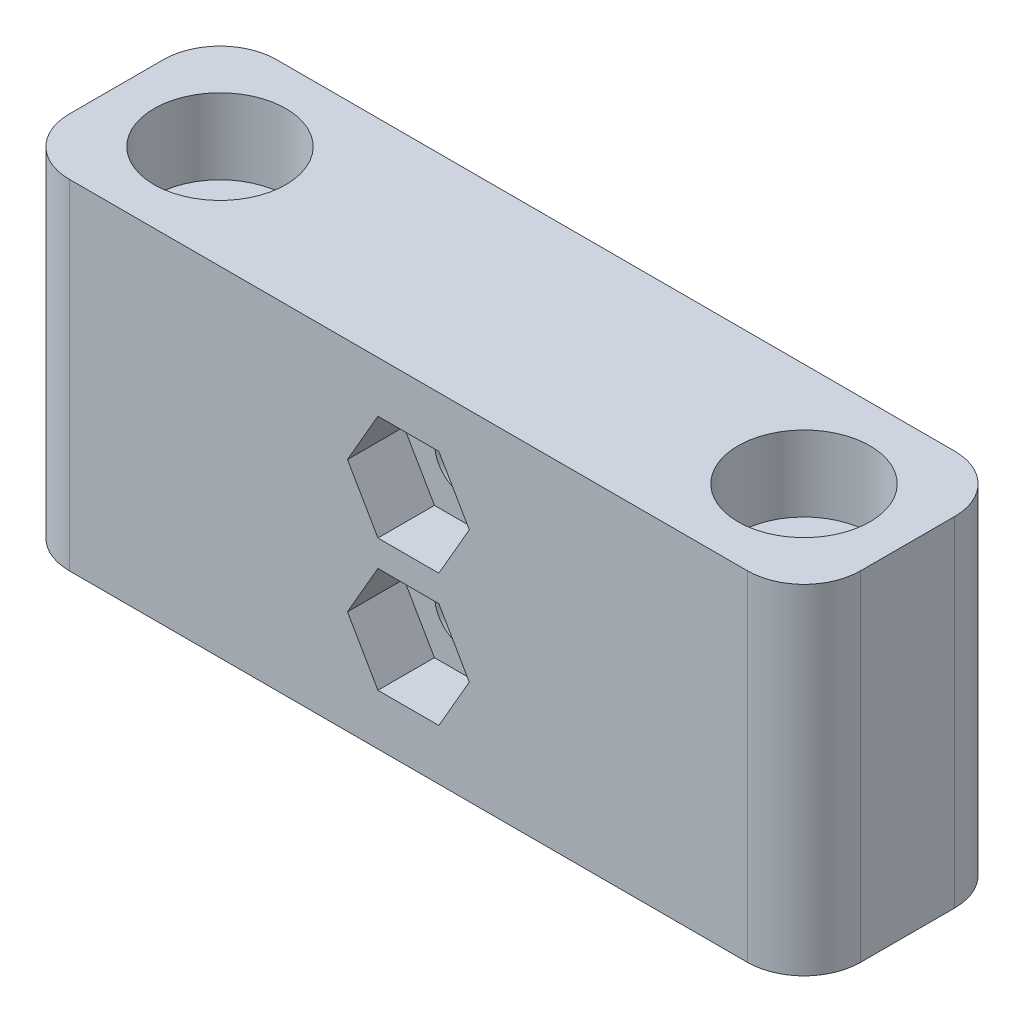
ISO-10303-21;
HEADER;
FILE_DESCRIPTION(('STEP AP214'),'2;1');
FILE_NAME('part.step','',(''),(''),'','','');
FILE_SCHEMA(('AUTOMOTIVE_DESIGN { 1 0 10303 214 1 1 1 1 }'));
ENDSEC;
DATA;
#1=APPLICATION_CONTEXT('core data for automotive mechanical design processes');
#2=APPLICATION_PROTOCOL_DEFINITION('international standard','automotive_design',2000,#1);
#3=PRODUCT_CONTEXT('',#1,'mechanical');
#4=PRODUCT('Part','Part','',(#3));
#5=PRODUCT_RELATED_PRODUCT_CATEGORY('part','',(#4));
#6=PRODUCT_DEFINITION_FORMATION('','',#4);
#7=PRODUCT_DEFINITION_CONTEXT('part definition',#1,'design');
#8=PRODUCT_DEFINITION('design','',#6,#7);
#9=PRODUCT_DEFINITION_SHAPE('','',#8);
#10=(LENGTH_UNIT() NAMED_UNIT(*) SI_UNIT(.MILLI.,.METRE.));
#11=(NAMED_UNIT(*) PLANE_ANGLE_UNIT() SI_UNIT($,.RADIAN.));
#12=(NAMED_UNIT(*) SI_UNIT($,.STERADIAN.) SOLID_ANGLE_UNIT());
#13=UNCERTAINTY_MEASURE_WITH_UNIT(LENGTH_MEASURE(1.E-05),#10,'distance_accuracy_value','');
#14=(GEOMETRIC_REPRESENTATION_CONTEXT(3) GLOBAL_UNCERTAINTY_ASSIGNED_CONTEXT((#13)) GLOBAL_UNIT_ASSIGNED_CONTEXT((#10,
#11,#12)) REPRESENTATION_CONTEXT('',''));
#15=CARTESIAN_POINT('',(0.,0.,0.));
#16=DIRECTION('',(0.,0.,1.));
#17=DIRECTION('',(1.,0.,0.));
#18=AXIS2_PLACEMENT_3D('',#15,#16,#17);
#19=CARTESIAN_POINT('',(-11.1557575960414,-8.24916440918298,62.8024606421806));
#20=DIRECTION('',(0.,0.,-1.));
#21=DIRECTION('',(-1.,0.,0.));
#22=AXIS2_PLACEMENT_3D('',#19,#20,#21);
#23=CYLINDRICAL_SURFACE('',#22,1.6);
#24=CARTESIAN_POINT('',(-11.1557575960414,-8.24916440918298,51.8024606421806));
#25=DIRECTION('',(0.,0.,-1.));
#26=DIRECTION('',(-1.,0.,0.));
#27=AXIS2_PLACEMENT_3D('',#24,#25,#26);
#28=CIRCLE('',#27,1.6);
#29=CARTESIAN_POINT('',(-12.7557575960414,-8.24916440918298,51.8024606421806));
#30=VERTEX_POINT('',#29);
#31=EDGE_CURVE('E278',#30,#30,#28,.T.);
#32=ORIENTED_EDGE('',*,*,#31,.T.);
#33=EDGE_LOOP('',(#32));
#34=FACE_BOUND('',#33,.T.);
#35=CARTESIAN_POINT('',(-11.1557575960414,-8.24916440918298,59.8024606421806));
#36=DIRECTION('',(0.,0.,1.));
#37=DIRECTION('',(1.,0.,0.));
#38=AXIS2_PLACEMENT_3D('',#35,#36,#37);
#39=CIRCLE('',#38,1.6);
#40=CARTESIAN_POINT('',(-9.55575759604137,-8.24916440918298,59.8024606421806));
#41=VERTEX_POINT('',#40);
#42=EDGE_CURVE('E38',#41,#41,#39,.F.);
#43=ORIENTED_EDGE('',*,*,#42,.F.);
#44=EDGE_LOOP('',(#43));
#45=FACE_BOUND('',#44,.T.);
#46=ADVANCED_FACE('F34',(#34,#45),#23,.F.);
#47=CARTESIAN_POINT('',(-11.1557575960414,-1.24916440918298,62.8024606421806));
#48=DIRECTION('',(0.,0.,-1.));
#49=DIRECTION('',(-1.,0.,0.));
#50=AXIS2_PLACEMENT_3D('',#47,#48,#49);
#51=CYLINDRICAL_SURFACE('',#50,1.6);
#52=CARTESIAN_POINT('',(-11.1557575960414,-1.24916440918298,51.8024606421806));
#53=DIRECTION('',(0.,0.,-1.));
#54=DIRECTION('',(-1.,0.,0.));
#55=AXIS2_PLACEMENT_3D('',#52,#53,#54);
#56=CIRCLE('',#55,1.6);
#57=CARTESIAN_POINT('',(-12.7557575960414,-1.24916440918298,51.8024606421806));
#58=VERTEX_POINT('',#57);
#59=EDGE_CURVE('E274',#58,#58,#56,.T.);
#60=ORIENTED_EDGE('',*,*,#59,.T.);
#61=EDGE_LOOP('',(#60));
#62=FACE_BOUND('',#61,.T.);
#63=CARTESIAN_POINT('',(-11.1557575960414,-1.24916440918298,59.8024606421806));
#64=DIRECTION('',(0.,0.,1.));
#65=DIRECTION('',(1.,0.,0.));
#66=AXIS2_PLACEMENT_3D('',#63,#64,#65);
#67=CIRCLE('',#66,1.6);
#68=CARTESIAN_POINT('',(-9.55575759604137,-1.24916440918298,59.8024606421806));
#69=VERTEX_POINT('',#68);
#70=EDGE_CURVE('E221',#69,#69,#67,.F.);
#71=ORIENTED_EDGE('',*,*,#70,.F.);
#72=EDGE_LOOP('',(#71));
#73=FACE_BOUND('',#72,.T.);
#74=ADVANCED_FACE('F368',(#62,#73),#51,.F.);
#75=CARTESIAN_POINT('',(-26.6557575960414,4.25083559081702,57.3024606421806));
#76=DIRECTION('',(0.,-1.,0.));
#77=DIRECTION('',(0.,0.,-1.));
#78=AXIS2_PLACEMENT_3D('',#75,#76,#77);
#79=CYLINDRICAL_SURFACE('',#78,1.6);
#80=CARTESIAN_POINT('',(-26.6557575960414,-13.749164409183,57.3024606421806));
#81=DIRECTION('',(0.,1.,0.));
#82=DIRECTION('',(0.,0.,1.));
#83=AXIS2_PLACEMENT_3D('',#80,#81,#82);
#84=CIRCLE('',#83,1.6);
#85=CARTESIAN_POINT('',(-26.6557575960414,-13.749164409183,58.9024606421806));
#86=VERTEX_POINT('',#85);
#87=EDGE_CURVE('E296',#86,#86,#84,.T.);
#88=ORIENTED_EDGE('',*,*,#87,.F.);
#89=EDGE_LOOP('',(#88));
#90=FACE_BOUND('',#89,.T.);
#91=CARTESIAN_POINT('',(-26.6557575960414,0.25083559081702,57.3024606421806));
#92=DIRECTION('',(0.,1.,0.));
#93=DIRECTION('',(0.,0.,1.));
#94=AXIS2_PLACEMENT_3D('',#91,#92,#93);
#95=CIRCLE('',#94,1.6);
#96=CARTESIAN_POINT('',(-26.6557575960414,0.25083559081702,58.9024606421806));
#97=VERTEX_POINT('',#96);
#98=EDGE_CURVE('E297',#97,#97,#95,.T.);
#99=ORIENTED_EDGE('',*,*,#98,.T.);
#100=EDGE_LOOP('',(#99));
#101=FACE_BOUND('',#100,.T.);
#102=ADVANCED_FACE('F374',(#90,#101),#79,.F.);
#103=CARTESIAN_POINT('',(4.34424240395863,4.25083559081702,57.3024606421806));
#104=DIRECTION('',(0.,-1.,0.));
#105=DIRECTION('',(0.,0.,-1.));
#106=AXIS2_PLACEMENT_3D('',#103,#104,#105);
#107=CYLINDRICAL_SURFACE('',#106,1.6);
#108=CARTESIAN_POINT('',(4.34424240395863,-13.749164409183,57.3024606421806));
#109=DIRECTION('',(0.,1.,0.));
#110=DIRECTION('',(0.,0.,1.));
#111=AXIS2_PLACEMENT_3D('',#108,#109,#110);
#112=CIRCLE('',#111,1.6);
#113=CARTESIAN_POINT('',(4.34424240395863,-13.749164409183,58.9024606421806));
#114=VERTEX_POINT('',#113);
#115=EDGE_CURVE('E293',#114,#114,#112,.T.);
#116=ORIENTED_EDGE('',*,*,#115,.F.);
#117=EDGE_LOOP('',(#116));
#118=FACE_BOUND('',#117,.T.);
#119=CARTESIAN_POINT('',(4.34424240395863,0.25083559081702,57.3024606421806));
#120=DIRECTION('',(0.,1.,0.));
#121=DIRECTION('',(0.,0.,1.));
#122=AXIS2_PLACEMENT_3D('',#119,#120,#121);
#123=CIRCLE('',#122,1.6);
#124=CARTESIAN_POINT('',(4.34424240395863,0.25083559081702,58.9024606421806));
#125=VERTEX_POINT('',#124);
#126=EDGE_CURVE('E284',#125,#125,#123,.T.);
#127=ORIENTED_EDGE('',*,*,#126,.T.);
#128=EDGE_LOOP('',(#127));
#129=FACE_BOUND('',#128,.T.);
#130=ADVANCED_FACE('F395',(#118,#129),#107,.F.);
#131=CARTESIAN_POINT('',(0.,4.25083559081702,0.));
#132=DIRECTION('',(0.,1.,0.));
#133=DIRECTION('',(0.,0.,1.));
#134=AXIS2_PLACEMENT_3D('',#131,#132,#133);
#135=PLANE('',#134);
#136=CARTESIAN_POINT('',(-26.6557575960414,4.25083559081702,57.3024606421806));
#137=DIRECTION('',(0.,1.,0.));
#138=DIRECTION('',(0.,0.,1.));
#139=AXIS2_PLACEMENT_3D('',#136,#137,#138);
#140=CIRCLE('',#139,3.5);
#141=CARTESIAN_POINT('',(-26.6557575960414,4.25083559081702,60.8024606421806));
#142=VERTEX_POINT('',#141);
#143=EDGE_CURVE('E285',#142,#142,#140,.T.);
#144=ORIENTED_EDGE('',*,*,#143,.F.);
#145=EDGE_LOOP('',(#144));
#146=FACE_BOUND('',#145,.T.);
#147=CARTESIAN_POINT('',(4.34424240395863,4.25083559081702,57.3024606421806));
#148=DIRECTION('',(0.,1.,0.));
#149=DIRECTION('',(0.,0.,1.));
#150=AXIS2_PLACEMENT_3D('',#147,#148,#149);
#151=CIRCLE('',#150,3.5);
#152=CARTESIAN_POINT('',(4.34424240395863,4.25083559081702,60.8024606421806));
#153=VERTEX_POINT('',#152);
#154=EDGE_CURVE('E277',#153,#153,#151,.T.);
#155=ORIENTED_EDGE('',*,*,#154,.F.);
#156=EDGE_LOOP('',(#155));
#157=FACE_BOUND('',#156,.T.);
#158=DIRECTION('',(1.,0.,0.));
#159=VECTOR('',#158,1.);
#160=CARTESIAN_POINT('',(-32.1557575960414,4.25083559081702,62.8024606421806));
#161=LINE('',#160,#159);
#162=CARTESIAN_POINT('',(-29.1557575960414,4.25083559081702,62.8024606421806));
#163=VERTEX_POINT('',#162);
#164=CARTESIAN_POINT('',(6.84424240395862,4.25083559081702,62.8024606421806));
#165=VERTEX_POINT('',#164);
#166=EDGE_CURVE('E304',#163,#165,#161,.T.);
#167=ORIENTED_EDGE('',*,*,#166,.T.);
#168=CARTESIAN_POINT('',(6.84424240395863,4.25083559081702,59.8024606421806));
#169=DIRECTION('',(0.,1.,0.));
#170=DIRECTION('',(0.,0.,1.));
#171=AXIS2_PLACEMENT_3D('',#168,#169,#170);
#172=CIRCLE('',#171,3.);
#173=CARTESIAN_POINT('',(9.84424240395863,4.25083559081702,59.8024606421806));
#174=VERTEX_POINT('',#173);
#175=EDGE_CURVE('E348',#165,#174,#172,.T.);
#176=ORIENTED_EDGE('',*,*,#175,.T.);
#177=DIRECTION('',(0.,0.,-1.));
#178=VECTOR('',#177,1.);
#179=CARTESIAN_POINT('',(9.84424240395863,4.25083559081702,51.8024606421806));
#180=LINE('',#179,#178);
#181=CARTESIAN_POINT('',(9.84424240395863,4.25083559081702,54.8024606421806));
#182=VERTEX_POINT('',#181);
#183=EDGE_CURVE('E308',#174,#182,#180,.T.);
#184=ORIENTED_EDGE('',*,*,#183,.T.);
#185=CARTESIAN_POINT('',(6.84424240395863,4.25083559081702,54.8024606421806));
#186=DIRECTION('',(0.,1.,0.));
#187=DIRECTION('',(0.,0.,1.));
#188=AXIS2_PLACEMENT_3D('',#185,#186,#187);
#189=CIRCLE('',#188,3.);
#190=CARTESIAN_POINT('',(6.84424240395862,4.25083559081702,51.8024606421806));
#191=VERTEX_POINT('',#190);
#192=EDGE_CURVE('E346',#182,#191,#189,.T.);
#193=ORIENTED_EDGE('',*,*,#192,.T.);
#194=DIRECTION('',(-1.,0.,0.));
#195=VECTOR('',#194,1.);
#196=CARTESIAN_POINT('',(-32.1557575960414,4.25083559081702,51.8024606421806));
#197=LINE('',#196,#195);
#198=CARTESIAN_POINT('',(-29.1557575960414,4.25083559081702,51.8024606421806));
#199=VERTEX_POINT('',#198);
#200=EDGE_CURVE('E311',#191,#199,#197,.T.);
#201=ORIENTED_EDGE('',*,*,#200,.T.);
#202=CARTESIAN_POINT('',(-29.1557575960414,4.25083559081702,54.8024606421806));
#203=DIRECTION('',(0.,1.,0.));
#204=DIRECTION('',(0.,0.,1.));
#205=AXIS2_PLACEMENT_3D('',#202,#203,#204);
#206=CIRCLE('',#205,3.);
#207=CARTESIAN_POINT('',(-32.1557575960414,4.25083559081702,54.8024606421806));
#208=VERTEX_POINT('',#207);
#209=EDGE_CURVE('E342',#199,#208,#206,.T.);
#210=ORIENTED_EDGE('',*,*,#209,.T.);
#211=DIRECTION('',(0.,0.,1.));
#212=VECTOR('',#211,1.);
#213=CARTESIAN_POINT('',(-32.1557575960414,4.25083559081702,51.8024606421806));
#214=LINE('',#213,#212);
#215=CARTESIAN_POINT('',(-32.1557575960414,4.25083559081702,59.8024606421806));
#216=VERTEX_POINT('',#215);
#217=EDGE_CURVE('E301',#208,#216,#214,.T.);
#218=ORIENTED_EDGE('',*,*,#217,.T.);
#219=CARTESIAN_POINT('',(-29.1557575960414,4.25083559081702,59.8024606421806));
#220=DIRECTION('',(0.,1.,0.));
#221=DIRECTION('',(0.,0.,1.));
#222=AXIS2_PLACEMENT_3D('',#219,#220,#221);
#223=CIRCLE('',#222,3.);
#224=EDGE_CURVE('E344',#216,#163,#223,.T.);
#225=ORIENTED_EDGE('',*,*,#224,.T.);
#226=EDGE_LOOP('',(#167,#176,#184,#193,#201,#210,#218,#225));
#227=FACE_BOUND('',#226,.T.);
#228=ADVANCED_FACE('F398',(#146,#157,#227),#135,.T.);
#229=CARTESIAN_POINT('',(0.,-13.749164409183,0.));
#230=DIRECTION('',(0.,1.,0.));
#231=DIRECTION('',(0.,0.,1.));
#232=AXIS2_PLACEMENT_3D('',#229,#230,#231);
#233=PLANE('',#232);
#234=DIRECTION('',(0.,0.,-1.));
#235=VECTOR('',#234,1.);
#236=CARTESIAN_POINT('',(9.84424240395863,-13.749164409183,51.8024606421806));
#237=LINE('',#236,#235);
#238=CARTESIAN_POINT('',(9.84424240395863,-13.749164409183,59.8024606421806));
#239=VERTEX_POINT('',#238);
#240=CARTESIAN_POINT('',(9.84424240395863,-13.749164409183,54.8024606421806));
#241=VERTEX_POINT('',#240);
#242=EDGE_CURVE('E320',#239,#241,#237,.T.);
#243=ORIENTED_EDGE('',*,*,#242,.F.);
#244=CARTESIAN_POINT('',(6.84424240395863,-13.749164409183,59.8024606421806));
#245=DIRECTION('',(0.,1.,0.));
#246=DIRECTION('',(0.,0.,1.));
#247=AXIS2_PLACEMENT_3D('',#244,#245,#246);
#248=CIRCLE('',#247,3.);
#249=CARTESIAN_POINT('',(6.84424240395862,-13.749164409183,62.8024606421806));
#250=VERTEX_POINT('',#249);
#251=EDGE_CURVE('E335',#239,#250,#248,.F.);
#252=ORIENTED_EDGE('',*,*,#251,.T.);
#253=DIRECTION('',(1.,0.,0.));
#254=VECTOR('',#253,1.);
#255=CARTESIAN_POINT('',(-32.1557575960414,-13.749164409183,62.8024606421806));
#256=LINE('',#255,#254);
#257=CARTESIAN_POINT('',(-29.1557575960414,-13.749164409183,62.8024606421806));
#258=VERTEX_POINT('',#257);
#259=EDGE_CURVE('E317',#258,#250,#256,.T.);
#260=ORIENTED_EDGE('',*,*,#259,.F.);
#261=CARTESIAN_POINT('',(-29.1557575960414,-13.749164409183,59.8024606421806));
#262=DIRECTION('',(0.,1.,0.));
#263=DIRECTION('',(0.,0.,1.));
#264=AXIS2_PLACEMENT_3D('',#261,#262,#263);
#265=CIRCLE('',#264,3.);
#266=CARTESIAN_POINT('',(-32.1557575960414,-13.749164409183,59.8024606421806));
#267=VERTEX_POINT('',#266);
#268=EDGE_CURVE('E331',#258,#267,#265,.F.);
#269=ORIENTED_EDGE('',*,*,#268,.T.);
#270=DIRECTION('',(0.,0.,1.));
#271=VECTOR('',#270,1.);
#272=CARTESIAN_POINT('',(-32.1557575960414,-13.749164409183,51.8024606421806));
#273=LINE('',#272,#271);
#274=CARTESIAN_POINT('',(-32.1557575960414,-13.749164409183,54.8024606421806));
#275=VERTEX_POINT('',#274);
#276=EDGE_CURVE('E300',#275,#267,#273,.T.);
#277=ORIENTED_EDGE('',*,*,#276,.F.);
#278=CARTESIAN_POINT('',(-29.1557575960414,-13.749164409183,54.8024606421806));
#279=DIRECTION('',(0.,1.,0.));
#280=DIRECTION('',(0.,0.,1.));
#281=AXIS2_PLACEMENT_3D('',#278,#279,#280);
#282=CIRCLE('',#281,3.);
#283=CARTESIAN_POINT('',(-29.1557575960414,-13.749164409183,51.8024606421806));
#284=VERTEX_POINT('',#283);
#285=EDGE_CURVE('E329',#275,#284,#282,.F.);
#286=ORIENTED_EDGE('',*,*,#285,.T.);
#287=DIRECTION('',(-1.,0.,0.));
#288=VECTOR('',#287,1.);
#289=CARTESIAN_POINT('',(-32.1557575960414,-13.749164409183,51.8024606421806));
#290=LINE('',#289,#288);
#291=CARTESIAN_POINT('',(6.84424240395862,-13.749164409183,51.8024606421806));
#292=VERTEX_POINT('',#291);
#293=EDGE_CURVE('E305',#292,#284,#290,.T.);
#294=ORIENTED_EDGE('',*,*,#293,.F.);
#295=CARTESIAN_POINT('',(6.84424240395863,-13.749164409183,54.8024606421806));
#296=DIRECTION('',(0.,1.,0.));
#297=DIRECTION('',(0.,0.,1.));
#298=AXIS2_PLACEMENT_3D('',#295,#296,#297);
#299=CIRCLE('',#298,3.);
#300=EDGE_CURVE('E333',#292,#241,#299,.F.);
#301=ORIENTED_EDGE('',*,*,#300,.T.);
#302=EDGE_LOOP('',(#243,#252,#260,#269,#277,#286,#294,#301));
#303=FACE_BOUND('',#302,.T.);
#304=ORIENTED_EDGE('',*,*,#87,.T.);
#305=EDGE_LOOP('',(#304));
#306=FACE_BOUND('',#305,.T.);
#307=ORIENTED_EDGE('',*,*,#115,.T.);
#308=EDGE_LOOP('',(#307));
#309=FACE_BOUND('',#308,.T.);
#310=ADVANCED_FACE('F405',(#303,#306,#309),#233,.F.);
#311=CARTESIAN_POINT('',(-32.1557575960414,4.25083559081702,51.8024606421806));
#312=DIRECTION('',(1.,0.,0.));
#313=DIRECTION('',(0.,0.,-1.));
#314=AXIS2_PLACEMENT_3D('',#311,#312,#313);
#315=PLANE('',#314);
#316=ORIENTED_EDGE('',*,*,#276,.T.);
#317=DIRECTION('',(0.,-1.,0.));
#318=VECTOR('',#317,1.);
#319=CARTESIAN_POINT('',(-32.1557575960414,4.25083559081702,59.8024606421806));
#320=LINE('',#319,#318);
#321=EDGE_CURVE('E11',#267,#216,#320,.F.);
#322=ORIENTED_EDGE('',*,*,#321,.T.);
#323=ORIENTED_EDGE('',*,*,#217,.F.);
#324=DIRECTION('',(0.,-1.,0.));
#325=VECTOR('',#324,1.);
#326=CARTESIAN_POINT('',(-32.1557575960414,4.25083559081702,54.8024606421806));
#327=LINE('',#326,#325);
#328=EDGE_CURVE('E43',#208,#275,#327,.T.);
#329=ORIENTED_EDGE('',*,*,#328,.T.);
#330=EDGE_LOOP('',(#316,#322,#323,#329));
#331=FACE_BOUND('',#330,.T.);
#332=ADVANCED_FACE('F409',(#331),#315,.F.);
#333=CARTESIAN_POINT('',(-32.1557575960414,4.25083559081702,62.8024606421806));
#334=DIRECTION('',(0.,0.,-1.));
#335=DIRECTION('',(-1.,0.,0.));
#336=AXIS2_PLACEMENT_3D('',#333,#334,#335);
#337=PLANE('',#336);
#338=DIRECTION('',(-0.5,0.866025403784438,0.));
#339=VECTOR('',#338,1.);
#340=CARTESIAN_POINT('',(-7.92259608857947,-1.24916440918298,62.8024606421806));
#341=LINE('',#340,#339);
#342=CARTESIAN_POINT('',(-7.92259608857947,-1.24916440918298,62.8024606421806));
#343=VERTEX_POINT('',#342);
#344=CARTESIAN_POINT('',(-9.53917684231043,1.55083559081702,62.8024606421806));
#345=VERTEX_POINT('',#344);
#346=EDGE_CURVE('E208',#343,#345,#341,.T.);
#347=ORIENTED_EDGE('',*,*,#346,.F.);
#348=DIRECTION('',(0.5,0.866025403784439,0.));
#349=VECTOR('',#348,1.);
#350=CARTESIAN_POINT('',(-9.53917684231042,-4.04916440918298,62.8024606421806));
#351=LINE('',#350,#349);
#352=CARTESIAN_POINT('',(-9.53917684231042,-4.04916440918298,62.8024606421806));
#353=VERTEX_POINT('',#352);
#354=EDGE_CURVE('E51',#353,#343,#351,.T.);
#355=ORIENTED_EDGE('',*,*,#354,.F.);
#356=DIRECTION('',(1.,0.,0.));
#357=VECTOR('',#356,1.);
#358=CARTESIAN_POINT('',(-12.7723383497723,-4.04916440918298,62.8024606421806));
#359=LINE('',#358,#357);
#360=CARTESIAN_POINT('',(-12.7723383497723,-4.04916440918298,62.8024606421806));
#361=VERTEX_POINT('',#360);
#362=EDGE_CURVE('E194',#361,#353,#359,.T.);
#363=ORIENTED_EDGE('',*,*,#362,.F.);
#364=DIRECTION('',(0.5,-0.866025403784439,0.));
#365=VECTOR('',#364,1.);
#366=CARTESIAN_POINT('',(-14.3889191035033,-1.24916440918298,62.8024606421806));
#367=LINE('',#366,#365);
#368=CARTESIAN_POINT('',(-14.3889191035033,-1.24916440918298,62.8024606421806));
#369=VERTEX_POINT('',#368);
#370=EDGE_CURVE('E197',#369,#361,#367,.T.);
#371=ORIENTED_EDGE('',*,*,#370,.F.);
#372=DIRECTION('',(-0.5,-0.866025403784439,0.));
#373=VECTOR('',#372,1.);
#374=CARTESIAN_POINT('',(-12.7723383497723,1.55083559081702,62.8024606421806));
#375=LINE('',#374,#373);
#376=CARTESIAN_POINT('',(-12.7723383497723,1.55083559081702,62.8024606421806));
#377=VERTEX_POINT('',#376);
#378=EDGE_CURVE('E214',#377,#369,#375,.T.);
#379=ORIENTED_EDGE('',*,*,#378,.F.);
#380=DIRECTION('',(-1.,0.,0.));
#381=VECTOR('',#380,1.);
#382=CARTESIAN_POINT('',(-9.53917684231043,1.55083559081702,62.8024606421806));
#383=LINE('',#382,#381);
#384=EDGE_CURVE('E211',#345,#377,#383,.T.);
#385=ORIENTED_EDGE('',*,*,#384,.F.);
#386=EDGE_LOOP('',(#347,#355,#363,#371,#379,#385));
#387=FACE_BOUND('',#386,.T.);
#388=DIRECTION('',(-0.500000000000001,0.866025403784438,0.));
#389=VECTOR('',#388,1.);
#390=CARTESIAN_POINT('',(-7.92259608857947,-8.24916440918298,62.8024606421806));
#391=LINE('',#390,#389);
#392=CARTESIAN_POINT('',(-7.92259608857947,-8.24916440918298,62.8024606421806));
#393=VERTEX_POINT('',#392);
#394=CARTESIAN_POINT('',(-9.53917684231042,-5.44916440918298,62.8024606421806));
#395=VERTEX_POINT('',#394);
#396=EDGE_CURVE('E250',#393,#395,#391,.T.);
#397=ORIENTED_EDGE('',*,*,#396,.F.);
#398=DIRECTION('',(0.5,0.866025403784438,0.));
#399=VECTOR('',#398,1.);
#400=CARTESIAN_POINT('',(-9.53917684231042,-11.049164409183,62.8024606421806));
#401=LINE('',#400,#399);
#402=CARTESIAN_POINT('',(-9.53917684231042,-11.049164409183,62.8024606421806));
#403=VERTEX_POINT('',#402);
#404=EDGE_CURVE('E59',#403,#393,#401,.T.);
#405=ORIENTED_EDGE('',*,*,#404,.F.);
#406=DIRECTION('',(1.,0.,0.));
#407=VECTOR('',#406,1.);
#408=CARTESIAN_POINT('',(-12.7723383497723,-11.049164409183,62.8024606421806));
#409=LINE('',#408,#407);
#410=CARTESIAN_POINT('',(-12.7723383497723,-11.049164409183,62.8024606421806));
#411=VERTEX_POINT('',#410);
#412=EDGE_CURVE('E233',#411,#403,#409,.T.);
#413=ORIENTED_EDGE('',*,*,#412,.F.);
#414=DIRECTION('',(0.5,-0.866025403784439,0.));
#415=VECTOR('',#414,1.);
#416=CARTESIAN_POINT('',(-14.3889191035033,-8.24916440918298,62.8024606421806));
#417=LINE('',#416,#415);
#418=CARTESIAN_POINT('',(-14.3889191035033,-8.24916440918298,62.8024606421806));
#419=VERTEX_POINT('',#418);
#420=EDGE_CURVE('E259',#419,#411,#417,.T.);
#421=ORIENTED_EDGE('',*,*,#420,.F.);
#422=DIRECTION('',(-0.5,-0.866025403784439,0.));
#423=VECTOR('',#422,1.);
#424=CARTESIAN_POINT('',(-12.7723383497723,-5.44916440918298,62.8024606421806));
#425=LINE('',#424,#423);
#426=CARTESIAN_POINT('',(-12.7723383497723,-5.44916440918298,62.8024606421806));
#427=VERTEX_POINT('',#426);
#428=EDGE_CURVE('E256',#427,#419,#425,.T.);
#429=ORIENTED_EDGE('',*,*,#428,.F.);
#430=DIRECTION('',(-1.,0.,0.));
#431=VECTOR('',#430,1.);
#432=CARTESIAN_POINT('',(-9.53917684231042,-5.44916440918298,62.8024606421806));
#433=LINE('',#432,#431);
#434=EDGE_CURVE('E253',#395,#427,#433,.T.);
#435=ORIENTED_EDGE('',*,*,#434,.F.);
#436=EDGE_LOOP('',(#397,#405,#413,#421,#429,#435));
#437=FACE_BOUND('',#436,.T.);
#438=ORIENTED_EDGE('',*,*,#259,.T.);
#439=DIRECTION('',(0.,-1.,0.));
#440=VECTOR('',#439,1.);
#441=CARTESIAN_POINT('',(6.84424240395863,4.25083559081702,62.8024606421806));
#442=LINE('',#441,#440);
#443=EDGE_CURVE('E340',#250,#165,#442,.F.);
#444=ORIENTED_EDGE('',*,*,#443,.T.);
#445=ORIENTED_EDGE('',*,*,#166,.F.);
#446=DIRECTION('',(0.,-1.,0.));
#447=VECTOR('',#446,1.);
#448=CARTESIAN_POINT('',(-29.1557575960414,4.25083559081702,62.8024606421806));
#449=LINE('',#448,#447);
#450=EDGE_CURVE('E337',#163,#258,#449,.T.);
#451=ORIENTED_EDGE('',*,*,#450,.T.);
#452=EDGE_LOOP('',(#438,#444,#445,#451));
#453=FACE_BOUND('',#452,.T.);
#454=ADVANCED_FACE('F419',(#387,#437,#453),#337,.F.);
#455=CARTESIAN_POINT('',(9.84424240395863,4.25083559081702,51.8024606421806));
#456=DIRECTION('',(-1.,0.,0.));
#457=DIRECTION('',(0.,0.,1.));
#458=AXIS2_PLACEMENT_3D('',#455,#456,#457);
#459=PLANE('',#458);
#460=ORIENTED_EDGE('',*,*,#183,.F.);
#461=DIRECTION('',(0.,-1.,0.));
#462=VECTOR('',#461,1.);
#463=CARTESIAN_POINT('',(9.84424240395863,4.25083559081702,59.8024606421806));
#464=LINE('',#463,#462);
#465=EDGE_CURVE('E326',#174,#239,#464,.T.);
#466=ORIENTED_EDGE('',*,*,#465,.T.);
#467=ORIENTED_EDGE('',*,*,#242,.T.);
#468=DIRECTION('',(0.,-1.,0.));
#469=VECTOR('',#468,1.);
#470=CARTESIAN_POINT('',(9.84424240395863,4.25083559081702,54.8024606421806));
#471=LINE('',#470,#469);
#472=EDGE_CURVE('E314',#241,#182,#471,.F.);
#473=ORIENTED_EDGE('',*,*,#472,.T.);
#474=EDGE_LOOP('',(#460,#466,#467,#473));
#475=FACE_BOUND('',#474,.T.);
#476=ADVANCED_FACE('F415',(#475),#459,.F.);
#477=CARTESIAN_POINT('',(-32.1557575960414,4.25083559081702,51.8024606421806));
#478=DIRECTION('',(0.,0.,1.));
#479=DIRECTION('',(1.,0.,0.));
#480=AXIS2_PLACEMENT_3D('',#477,#478,#479);
#481=PLANE('',#480);
#482=ORIENTED_EDGE('',*,*,#59,.F.);
#483=EDGE_LOOP('',(#482));
#484=FACE_BOUND('',#483,.T.);
#485=ORIENTED_EDGE('',*,*,#31,.F.);
#486=EDGE_LOOP('',(#485));
#487=FACE_BOUND('',#486,.T.);
#488=ORIENTED_EDGE('',*,*,#200,.F.);
#489=DIRECTION('',(0.,-1.,0.));
#490=VECTOR('',#489,1.);
#491=CARTESIAN_POINT('',(6.84424240395863,4.25083559081702,51.8024606421806));
#492=LINE('',#491,#490);
#493=EDGE_CURVE('E352',#191,#292,#492,.T.);
#494=ORIENTED_EDGE('',*,*,#493,.T.);
#495=ORIENTED_EDGE('',*,*,#293,.T.);
#496=DIRECTION('',(0.,-1.,0.));
#497=VECTOR('',#496,1.);
#498=CARTESIAN_POINT('',(-29.1557575960414,4.25083559081702,51.8024606421806));
#499=LINE('',#498,#497);
#500=EDGE_CURVE('E350',#284,#199,#499,.F.);
#501=ORIENTED_EDGE('',*,*,#500,.T.);
#502=EDGE_LOOP('',(#488,#494,#495,#501));
#503=FACE_BOUND('',#502,.T.);
#504=ADVANCED_FACE('F411',(#484,#487,#503),#481,.F.);
#505=CARTESIAN_POINT('',(6.84424240395863,4.25083559081702,59.8024606421806));
#506=DIRECTION('',(0.,-1.,0.));
#507=DIRECTION('',(0.,0.,-1.));
#508=AXIS2_PLACEMENT_3D('',#505,#506,#507);
#509=CYLINDRICAL_SURFACE('',#508,3.);
#510=ORIENTED_EDGE('',*,*,#175,.F.);
#511=ORIENTED_EDGE('',*,*,#443,.F.);
#512=ORIENTED_EDGE('',*,*,#251,.F.);
#513=ORIENTED_EDGE('',*,*,#465,.F.);
#514=EDGE_LOOP('',(#510,#511,#512,#513));
#515=FACE_BOUND('',#514,.T.);
#516=ADVANCED_FACE('F414',(#515),#509,.T.);
#517=CARTESIAN_POINT('',(6.84424240395863,4.25083559081702,54.8024606421806));
#518=DIRECTION('',(0.,-1.,0.));
#519=DIRECTION('',(0.,0.,-1.));
#520=AXIS2_PLACEMENT_3D('',#517,#518,#519);
#521=CYLINDRICAL_SURFACE('',#520,3.);
#522=ORIENTED_EDGE('',*,*,#192,.F.);
#523=ORIENTED_EDGE('',*,*,#472,.F.);
#524=ORIENTED_EDGE('',*,*,#300,.F.);
#525=ORIENTED_EDGE('',*,*,#493,.F.);
#526=EDGE_LOOP('',(#522,#523,#524,#525));
#527=FACE_BOUND('',#526,.T.);
#528=ADVANCED_FACE('F429',(#527),#521,.T.);
#529=CARTESIAN_POINT('',(-29.1557575960414,4.25083559081702,59.8024606421806));
#530=DIRECTION('',(0.,-1.,0.));
#531=DIRECTION('',(0.,0.,-1.));
#532=AXIS2_PLACEMENT_3D('',#529,#530,#531);
#533=CYLINDRICAL_SURFACE('',#532,3.);
#534=ORIENTED_EDGE('',*,*,#224,.F.);
#535=ORIENTED_EDGE('',*,*,#321,.F.);
#536=ORIENTED_EDGE('',*,*,#268,.F.);
#537=ORIENTED_EDGE('',*,*,#450,.F.);
#538=EDGE_LOOP('',(#534,#535,#536,#537));
#539=FACE_BOUND('',#538,.T.);
#540=ADVANCED_FACE('F432',(#539),#533,.T.);
#541=CARTESIAN_POINT('',(-29.1557575960414,4.25083559081702,54.8024606421806));
#542=DIRECTION('',(0.,-1.,0.));
#543=DIRECTION('',(0.,0.,-1.));
#544=AXIS2_PLACEMENT_3D('',#541,#542,#543);
#545=CYLINDRICAL_SURFACE('',#544,3.);
#546=ORIENTED_EDGE('',*,*,#209,.F.);
#547=ORIENTED_EDGE('',*,*,#500,.F.);
#548=ORIENTED_EDGE('',*,*,#285,.F.);
#549=ORIENTED_EDGE('',*,*,#328,.F.);
#550=EDGE_LOOP('',(#546,#547,#548,#549));
#551=FACE_BOUND('',#550,.T.);
#552=ADVANCED_FACE('F36',(#551),#545,.T.);
#553=CARTESIAN_POINT('',(4.34424240395863,0.25083559081702,57.3024606421806));
#554=DIRECTION('',(0.,1.,0.));
#555=DIRECTION('',(0.,0.,1.));
#556=AXIS2_PLACEMENT_3D('',#553,#554,#555);
#557=CYLINDRICAL_SURFACE('',#556,3.5);
#558=CARTESIAN_POINT('',(4.34424240395863,0.25083559081702,57.3024606421806));
#559=DIRECTION('',(0.,1.,0.));
#560=DIRECTION('',(0.,0.,1.));
#561=AXIS2_PLACEMENT_3D('',#558,#559,#560);
#562=CIRCLE('',#561,3.5);
#563=CARTESIAN_POINT('',(4.34424240395863,0.25083559081702,60.8024606421806));
#564=VERTEX_POINT('',#563);
#565=EDGE_CURVE('E288',#564,#564,#562,.T.);
#566=ORIENTED_EDGE('',*,*,#565,.F.);
#567=EDGE_LOOP('',(#566));
#568=FACE_BOUND('',#567,.T.);
#569=ORIENTED_EDGE('',*,*,#154,.T.);
#570=EDGE_LOOP('',(#569));
#571=FACE_BOUND('',#570,.T.);
#572=ADVANCED_FACE('F390',(#568,#571),#557,.F.);
#573=CARTESIAN_POINT('',(4.34424240395863,0.25083559081702,57.3024606421806));
#574=DIRECTION('',(0.,1.,0.));
#575=DIRECTION('',(0.,0.,1.));
#576=AXIS2_PLACEMENT_3D('',#573,#574,#575);
#577=PLANE('',#576);
#578=ORIENTED_EDGE('',*,*,#126,.F.);
#579=EDGE_LOOP('',(#578));
#580=FACE_BOUND('',#579,.T.);
#581=ORIENTED_EDGE('',*,*,#565,.T.);
#582=EDGE_LOOP('',(#581));
#583=FACE_BOUND('',#582,.T.);
#584=ADVANCED_FACE('F386',(#580,#583),#577,.T.);
#585=CARTESIAN_POINT('',(-26.6557575960414,0.25083559081702,57.3024606421806));
#586=DIRECTION('',(0.,1.,0.));
#587=DIRECTION('',(0.,0.,1.));
#588=AXIS2_PLACEMENT_3D('',#585,#586,#587);
#589=CYLINDRICAL_SURFACE('',#588,3.5);
#590=CARTESIAN_POINT('',(-26.6557575960414,0.25083559081702,57.3024606421806));
#591=DIRECTION('',(0.,1.,0.));
#592=DIRECTION('',(0.,0.,1.));
#593=AXIS2_PLACEMENT_3D('',#590,#591,#592);
#594=CIRCLE('',#593,3.5);
#595=CARTESIAN_POINT('',(-26.6557575960414,0.25083559081702,60.8024606421806));
#596=VERTEX_POINT('',#595);
#597=EDGE_CURVE('E281',#596,#596,#594,.T.);
#598=ORIENTED_EDGE('',*,*,#597,.F.);
#599=EDGE_LOOP('',(#598));
#600=FACE_BOUND('',#599,.T.);
#601=ORIENTED_EDGE('',*,*,#143,.T.);
#602=EDGE_LOOP('',(#601));
#603=FACE_BOUND('',#602,.T.);
#604=ADVANCED_FACE('F382',(#600,#603),#589,.F.);
#605=CARTESIAN_POINT('',(-26.6557575960414,0.25083559081702,57.3024606421806));
#606=DIRECTION('',(0.,1.,0.));
#607=DIRECTION('',(0.,0.,1.));
#608=AXIS2_PLACEMENT_3D('',#605,#606,#607);
#609=PLANE('',#608);
#610=ORIENTED_EDGE('',*,*,#98,.F.);
#611=EDGE_LOOP('',(#610));
#612=FACE_BOUND('',#611,.T.);
#613=ORIENTED_EDGE('',*,*,#597,.T.);
#614=EDGE_LOOP('',(#613));
#615=FACE_BOUND('',#614,.T.);
#616=ADVANCED_FACE('F379',(#612,#615),#609,.T.);
#617=CARTESIAN_POINT('',(0.,0.,59.8024606421806));
#618=DIRECTION('',(0.,0.,1.));
#619=DIRECTION('',(1.,0.,0.));
#620=AXIS2_PLACEMENT_3D('',#617,#618,#619);
#621=PLANE('',#620);
#622=DIRECTION('',(0.5,0.866025403784439,0.));
#623=VECTOR('',#622,1.);
#624=CARTESIAN_POINT('',(-9.53917684231042,-4.04916440918298,59.8024606421806));
#625=LINE('',#624,#623);
#626=CARTESIAN_POINT('',(-9.53917684231042,-4.04916440918298,59.8024606421806));
#627=VERTEX_POINT('',#626);
#628=CARTESIAN_POINT('',(-7.92259608857947,-1.24916440918298,59.8024606421806));
#629=VERTEX_POINT('',#628);
#630=EDGE_CURVE('E174',#627,#629,#625,.T.);
#631=ORIENTED_EDGE('',*,*,#630,.T.);
#632=DIRECTION('',(-0.5,0.866025403784438,0.));
#633=VECTOR('',#632,1.);
#634=CARTESIAN_POINT('',(-7.92259608857947,-1.24916440918298,59.8024606421806));
#635=LINE('',#634,#633);
#636=CARTESIAN_POINT('',(-9.53917684231043,1.55083559081702,59.8024606421806));
#637=VERTEX_POINT('',#636);
#638=EDGE_CURVE('E183',#629,#637,#635,.T.);
#639=ORIENTED_EDGE('',*,*,#638,.T.);
#640=DIRECTION('',(-1.,0.,0.));
#641=VECTOR('',#640,1.);
#642=CARTESIAN_POINT('',(-9.53917684231043,1.55083559081702,59.8024606421806));
#643=LINE('',#642,#641);
#644=CARTESIAN_POINT('',(-12.7723383497723,1.55083559081702,59.8024606421806));
#645=VERTEX_POINT('',#644);
#646=EDGE_CURVE('E188',#637,#645,#643,.T.);
#647=ORIENTED_EDGE('',*,*,#646,.T.);
#648=DIRECTION('',(-0.5,-0.866025403784439,0.));
#649=VECTOR('',#648,1.);
#650=CARTESIAN_POINT('',(-12.7723383497723,1.55083559081702,59.8024606421806));
#651=LINE('',#650,#649);
#652=CARTESIAN_POINT('',(-14.3889191035033,-1.24916440918298,59.8024606421806));
#653=VERTEX_POINT('',#652);
#654=EDGE_CURVE('E201',#645,#653,#651,.T.);
#655=ORIENTED_EDGE('',*,*,#654,.T.);
#656=DIRECTION('',(0.5,-0.866025403784439,0.));
#657=VECTOR('',#656,1.);
#658=CARTESIAN_POINT('',(-14.3889191035033,-1.24916440918298,59.8024606421806));
#659=LINE('',#658,#657);
#660=CARTESIAN_POINT('',(-12.7723383497723,-4.04916440918298,59.8024606421806));
#661=VERTEX_POINT('',#660);
#662=EDGE_CURVE('E204',#653,#661,#659,.T.);
#663=ORIENTED_EDGE('',*,*,#662,.T.);
#664=DIRECTION('',(1.,0.,0.));
#665=VECTOR('',#664,1.);
#666=CARTESIAN_POINT('',(-12.7723383497723,-4.04916440918298,59.8024606421806));
#667=LINE('',#666,#665);
#668=EDGE_CURVE('E180',#661,#627,#667,.T.);
#669=ORIENTED_EDGE('',*,*,#668,.T.);
#670=EDGE_LOOP('',(#631,#639,#647,#655,#663,#669));
#671=FACE_BOUND('',#670,.T.);
#672=ORIENTED_EDGE('',*,*,#70,.T.);
#673=EDGE_LOOP('',(#672));
#674=FACE_BOUND('',#673,.T.);
#675=ADVANCED_FACE('F190',(#671,#674),#621,.T.);
#676=CARTESIAN_POINT('',(-9.53917684231042,-4.04916440918298,59.8024606421806));
#677=DIRECTION('',(0.866025403784439,-0.5,0.));
#678=DIRECTION('',(0.5,0.866025403784439,0.));
#679=AXIS2_PLACEMENT_3D('',#676,#677,#678);
#680=PLANE('',#679);
#681=ORIENTED_EDGE('',*,*,#354,.T.);
#682=DIRECTION('',(0.,0.,1.));
#683=VECTOR('',#682,1.);
#684=CARTESIAN_POINT('',(-7.92259608857947,-1.24916440918298,59.8024606421806));
#685=LINE('',#684,#683);
#686=EDGE_CURVE('E170',#629,#343,#685,.T.);
#687=ORIENTED_EDGE('',*,*,#686,.F.);
#688=ORIENTED_EDGE('',*,*,#630,.F.);
#689=DIRECTION('',(0.,0.,1.));
#690=VECTOR('',#689,1.);
#691=CARTESIAN_POINT('',(-9.53917684231042,-4.04916440918298,59.8024606421806));
#692=LINE('',#691,#690);
#693=EDGE_CURVE('E219',#627,#353,#692,.T.);
#694=ORIENTED_EDGE('',*,*,#693,.T.);
#695=EDGE_LOOP('',(#681,#687,#688,#694));
#696=FACE_BOUND('',#695,.T.);
#697=ADVANCED_FACE('F172',(#696),#680,.F.);
#698=CARTESIAN_POINT('',(-12.7723383497723,-4.04916440918298,59.8024606421806));
#699=DIRECTION('',(0.,-1.,0.));
#700=DIRECTION('',(0.,0.,-1.));
#701=AXIS2_PLACEMENT_3D('',#698,#699,#700);
#702=PLANE('',#701);
#703=ORIENTED_EDGE('',*,*,#362,.T.);
#704=ORIENTED_EDGE('',*,*,#693,.F.);
#705=ORIENTED_EDGE('',*,*,#668,.F.);
#706=DIRECTION('',(0.,0.,1.));
#707=VECTOR('',#706,1.);
#708=CARTESIAN_POINT('',(-12.7723383497723,-4.04916440918298,59.8024606421806));
#709=LINE('',#708,#707);
#710=EDGE_CURVE('E222',#661,#361,#709,.T.);
#711=ORIENTED_EDGE('',*,*,#710,.T.);
#712=EDGE_LOOP('',(#703,#704,#705,#711));
#713=FACE_BOUND('',#712,.T.);
#714=ADVANCED_FACE('F514',(#713),#702,.F.);
#715=CARTESIAN_POINT('',(-14.3889191035033,-1.24916440918298,59.8024606421806));
#716=DIRECTION('',(-0.866025403784439,-0.5,0.));
#717=DIRECTION('',(0.5,-0.866025403784439,0.));
#718=AXIS2_PLACEMENT_3D('',#715,#716,#717);
#719=PLANE('',#718);
#720=ORIENTED_EDGE('',*,*,#370,.T.);
#721=ORIENTED_EDGE('',*,*,#710,.F.);
#722=ORIENTED_EDGE('',*,*,#662,.F.);
#723=DIRECTION('',(0.,0.,1.));
#724=VECTOR('',#723,1.);
#725=CARTESIAN_POINT('',(-14.3889191035033,-1.24916440918298,59.8024606421806));
#726=LINE('',#725,#724);
#727=EDGE_CURVE('E224',#653,#369,#726,.T.);
#728=ORIENTED_EDGE('',*,*,#727,.T.);
#729=EDGE_LOOP('',(#720,#721,#722,#728));
#730=FACE_BOUND('',#729,.T.);
#731=ADVANCED_FACE('F521',(#730),#719,.F.);
#732=CARTESIAN_POINT('',(-12.7723383497723,1.55083559081702,59.8024606421806));
#733=DIRECTION('',(-0.866025403784438,0.5,0.));
#734=DIRECTION('',(-0.5,-0.866025403784439,0.));
#735=AXIS2_PLACEMENT_3D('',#732,#733,#734);
#736=PLANE('',#735);
#737=ORIENTED_EDGE('',*,*,#378,.T.);
#738=ORIENTED_EDGE('',*,*,#727,.F.);
#739=ORIENTED_EDGE('',*,*,#654,.F.);
#740=DIRECTION('',(0.,0.,1.));
#741=VECTOR('',#740,1.);
#742=CARTESIAN_POINT('',(-12.7723383497723,1.55083559081702,59.8024606421806));
#743=LINE('',#742,#741);
#744=EDGE_CURVE('E226',#645,#377,#743,.T.);
#745=ORIENTED_EDGE('',*,*,#744,.T.);
#746=EDGE_LOOP('',(#737,#738,#739,#745));
#747=FACE_BOUND('',#746,.T.);
#748=ADVANCED_FACE('F529',(#747),#736,.F.);
#749=CARTESIAN_POINT('',(-9.53917684231043,1.55083559081702,59.8024606421806));
#750=DIRECTION('',(0.,1.,0.));
#751=DIRECTION('',(0.,0.,1.));
#752=AXIS2_PLACEMENT_3D('',#749,#750,#751);
#753=PLANE('',#752);
#754=ORIENTED_EDGE('',*,*,#384,.T.);
#755=ORIENTED_EDGE('',*,*,#744,.F.);
#756=ORIENTED_EDGE('',*,*,#646,.F.);
#757=DIRECTION('',(0.,0.,1.));
#758=VECTOR('',#757,1.);
#759=CARTESIAN_POINT('',(-9.53917684231043,1.55083559081702,59.8024606421806));
#760=LINE('',#759,#758);
#761=EDGE_CURVE('E179',#637,#345,#760,.T.);
#762=ORIENTED_EDGE('',*,*,#761,.T.);
#763=EDGE_LOOP('',(#754,#755,#756,#762));
#764=FACE_BOUND('',#763,.T.);
#765=ADVANCED_FACE('F537',(#764),#753,.F.);
#766=CARTESIAN_POINT('',(-7.92259608857947,-1.24916440918298,59.8024606421806));
#767=DIRECTION('',(0.866025403784438,0.5,0.));
#768=DIRECTION('',(-0.5,0.866025403784438,0.));
#769=AXIS2_PLACEMENT_3D('',#766,#767,#768);
#770=PLANE('',#769);
#771=ORIENTED_EDGE('',*,*,#346,.T.);
#772=ORIENTED_EDGE('',*,*,#761,.F.);
#773=ORIENTED_EDGE('',*,*,#638,.F.);
#774=ORIENTED_EDGE('',*,*,#686,.T.);
#775=EDGE_LOOP('',(#771,#772,#773,#774));
#776=FACE_BOUND('',#775,.T.);
#777=ADVANCED_FACE('F184',(#776),#770,.F.);
#778=CARTESIAN_POINT('',(0.,0.,59.8024606421806));
#779=DIRECTION('',(0.,0.,1.));
#780=DIRECTION('',(1.,0.,0.));
#781=AXIS2_PLACEMENT_3D('',#778,#779,#780);
#782=PLANE('',#781);
#783=DIRECTION('',(0.5,0.866025403784438,0.));
#784=VECTOR('',#783,1.);
#785=CARTESIAN_POINT('',(-9.53917684231042,-11.049164409183,59.8024606421806));
#786=LINE('',#785,#784);
#787=CARTESIAN_POINT('',(-9.53917684231042,-11.049164409183,59.8024606421806));
#788=VERTEX_POINT('',#787);
#789=CARTESIAN_POINT('',(-7.92259608857947,-8.24916440918298,59.8024606421806));
#790=VERTEX_POINT('',#789);
#791=EDGE_CURVE('E229',#788,#790,#786,.T.);
#792=ORIENTED_EDGE('',*,*,#791,.T.);
#793=DIRECTION('',(-0.500000000000001,0.866025403784438,0.));
#794=VECTOR('',#793,1.);
#795=CARTESIAN_POINT('',(-7.92259608857947,-8.24916440918298,59.8024606421806));
#796=LINE('',#795,#794);
#797=CARTESIAN_POINT('',(-9.53917684231042,-5.44916440918298,59.8024606421806));
#798=VERTEX_POINT('',#797);
#799=EDGE_CURVE('E232',#790,#798,#796,.T.);
#800=ORIENTED_EDGE('',*,*,#799,.T.);
#801=DIRECTION('',(-1.,0.,0.));
#802=VECTOR('',#801,1.);
#803=CARTESIAN_POINT('',(-9.53917684231042,-5.44916440918298,59.8024606421806));
#804=LINE('',#803,#802);
#805=CARTESIAN_POINT('',(-12.7723383497723,-5.44916440918298,59.8024606421806));
#806=VERTEX_POINT('',#805);
#807=EDGE_CURVE('E236',#798,#806,#804,.T.);
#808=ORIENTED_EDGE('',*,*,#807,.T.);
#809=DIRECTION('',(-0.5,-0.866025403784439,0.));
#810=VECTOR('',#809,1.);
#811=CARTESIAN_POINT('',(-12.7723383497723,-5.44916440918298,59.8024606421806));
#812=LINE('',#811,#810);
#813=CARTESIAN_POINT('',(-14.3889191035033,-8.24916440918298,59.8024606421806));
#814=VERTEX_POINT('',#813);
#815=EDGE_CURVE('E239',#806,#814,#812,.T.);
#816=ORIENTED_EDGE('',*,*,#815,.T.);
#817=DIRECTION('',(0.5,-0.866025403784439,0.));
#818=VECTOR('',#817,1.);
#819=CARTESIAN_POINT('',(-14.3889191035033,-8.24916440918298,59.8024606421806));
#820=LINE('',#819,#818);
#821=CARTESIAN_POINT('',(-12.7723383497723,-11.049164409183,59.8024606421806));
#822=VERTEX_POINT('',#821);
#823=EDGE_CURVE('E242',#814,#822,#820,.T.);
#824=ORIENTED_EDGE('',*,*,#823,.T.);
#825=DIRECTION('',(1.,0.,0.));
#826=VECTOR('',#825,1.);
#827=CARTESIAN_POINT('',(-12.7723383497723,-11.049164409183,59.8024606421806));
#828=LINE('',#827,#826);
#829=EDGE_CURVE('E245',#822,#788,#828,.T.);
#830=ORIENTED_EDGE('',*,*,#829,.T.);
#831=EDGE_LOOP('',(#792,#800,#808,#816,#824,#830));
#832=FACE_BOUND('',#831,.T.);
#833=ORIENTED_EDGE('',*,*,#42,.T.);
#834=EDGE_LOOP('',(#833));
#835=FACE_BOUND('',#834,.T.);
#836=ADVANCED_FACE('F365',(#832,#835),#782,.T.);
#837=CARTESIAN_POINT('',(-9.53917684231042,-11.049164409183,59.8024606421806));
#838=DIRECTION('',(0.866025403784439,-0.5,0.));
#839=DIRECTION('',(0.5,0.866025403784439,0.));
#840=AXIS2_PLACEMENT_3D('',#837,#838,#839);
#841=PLANE('',#840);
#842=ORIENTED_EDGE('',*,*,#404,.T.);
#843=DIRECTION('',(0.,0.,1.));
#844=VECTOR('',#843,1.);
#845=CARTESIAN_POINT('',(-7.92259608857947,-8.24916440918298,59.8024606421806));
#846=LINE('',#845,#844);
#847=EDGE_CURVE('E248',#790,#393,#846,.T.);
#848=ORIENTED_EDGE('',*,*,#847,.F.);
#849=ORIENTED_EDGE('',*,*,#791,.F.);
#850=DIRECTION('',(0.,0.,1.));
#851=VECTOR('',#850,1.);
#852=CARTESIAN_POINT('',(-9.53917684231042,-11.049164409183,59.8024606421806));
#853=LINE('',#852,#851);
#854=EDGE_CURVE('E209',#788,#403,#853,.T.);
#855=ORIENTED_EDGE('',*,*,#854,.T.);
#856=EDGE_LOOP('',(#842,#848,#849,#855));
#857=FACE_BOUND('',#856,.T.);
#858=ADVANCED_FACE('F558',(#857),#841,.F.);
#859=CARTESIAN_POINT('',(-12.7723383497723,-11.049164409183,59.8024606421806));
#860=DIRECTION('',(0.,-1.,0.));
#861=DIRECTION('',(0.,0.,-1.));
#862=AXIS2_PLACEMENT_3D('',#859,#860,#861);
#863=PLANE('',#862);
#864=ORIENTED_EDGE('',*,*,#412,.T.);
#865=ORIENTED_EDGE('',*,*,#854,.F.);
#866=ORIENTED_EDGE('',*,*,#829,.F.);
#867=DIRECTION('',(0.,0.,1.));
#868=VECTOR('',#867,1.);
#869=CARTESIAN_POINT('',(-12.7723383497723,-11.049164409183,59.8024606421806));
#870=LINE('',#869,#868);
#871=EDGE_CURVE('E265',#822,#411,#870,.T.);
#872=ORIENTED_EDGE('',*,*,#871,.T.);
#873=EDGE_LOOP('',(#864,#865,#866,#872));
#874=FACE_BOUND('',#873,.T.);
#875=ADVANCED_FACE('F566',(#874),#863,.F.);
#876=CARTESIAN_POINT('',(-14.3889191035033,-8.24916440918298,59.8024606421806));
#877=DIRECTION('',(-0.866025403784439,-0.5,0.));
#878=DIRECTION('',(0.5,-0.866025403784439,0.));
#879=AXIS2_PLACEMENT_3D('',#876,#877,#878);
#880=PLANE('',#879);
#881=ORIENTED_EDGE('',*,*,#420,.T.);
#882=ORIENTED_EDGE('',*,*,#871,.F.);
#883=ORIENTED_EDGE('',*,*,#823,.F.);
#884=DIRECTION('',(0.,0.,1.));
#885=VECTOR('',#884,1.);
#886=CARTESIAN_POINT('',(-14.3889191035033,-8.24916440918298,59.8024606421806));
#887=LINE('',#886,#885);
#888=EDGE_CURVE('E267',#814,#419,#887,.T.);
#889=ORIENTED_EDGE('',*,*,#888,.T.);
#890=EDGE_LOOP('',(#881,#882,#883,#889));
#891=FACE_BOUND('',#890,.T.);
#892=ADVANCED_FACE('F572',(#891),#880,.F.);
#893=CARTESIAN_POINT('',(-12.7723383497723,-5.44916440918298,59.8024606421806));
#894=DIRECTION('',(-0.866025403784439,0.5,0.));
#895=DIRECTION('',(-0.5,-0.866025403784439,0.));
#896=AXIS2_PLACEMENT_3D('',#893,#894,#895);
#897=PLANE('',#896);
#898=ORIENTED_EDGE('',*,*,#428,.T.);
#899=ORIENTED_EDGE('',*,*,#888,.F.);
#900=ORIENTED_EDGE('',*,*,#815,.F.);
#901=DIRECTION('',(0.,0.,1.));
#902=VECTOR('',#901,1.);
#903=CARTESIAN_POINT('',(-12.7723383497723,-5.44916440918298,59.8024606421806));
#904=LINE('',#903,#902);
#905=EDGE_CURVE('E269',#806,#427,#904,.T.);
#906=ORIENTED_EDGE('',*,*,#905,.T.);
#907=EDGE_LOOP('',(#898,#899,#900,#906));
#908=FACE_BOUND('',#907,.T.);
#909=ADVANCED_FACE('F580',(#908),#897,.F.);
#910=CARTESIAN_POINT('',(-9.53917684231042,-5.44916440918298,59.8024606421806));
#911=DIRECTION('',(0.,1.,0.));
#912=DIRECTION('',(0.,0.,1.));
#913=AXIS2_PLACEMENT_3D('',#910,#911,#912);
#914=PLANE('',#913);
#915=ORIENTED_EDGE('',*,*,#434,.T.);
#916=ORIENTED_EDGE('',*,*,#905,.F.);
#917=ORIENTED_EDGE('',*,*,#807,.F.);
#918=DIRECTION('',(0.,0.,1.));
#919=VECTOR('',#918,1.);
#920=CARTESIAN_POINT('',(-9.53917684231042,-5.44916440918298,59.8024606421806));
#921=LINE('',#920,#919);
#922=EDGE_CURVE('E271',#798,#395,#921,.T.);
#923=ORIENTED_EDGE('',*,*,#922,.T.);
#924=EDGE_LOOP('',(#915,#916,#917,#923));
#925=FACE_BOUND('',#924,.T.);
#926=ADVANCED_FACE('F588',(#925),#914,.F.);
#927=CARTESIAN_POINT('',(-7.92259608857947,-8.24916440918298,59.8024606421806));
#928=DIRECTION('',(0.866025403784438,0.5,0.));
#929=DIRECTION('',(-0.500000000000001,0.866025403784438,0.));
#930=AXIS2_PLACEMENT_3D('',#927,#928,#929);
#931=PLANE('',#930);
#932=ORIENTED_EDGE('',*,*,#396,.T.);
#933=ORIENTED_EDGE('',*,*,#922,.F.);
#934=ORIENTED_EDGE('',*,*,#799,.F.);
#935=ORIENTED_EDGE('',*,*,#847,.T.);
#936=EDGE_LOOP('',(#932,#933,#934,#935));
#937=FACE_BOUND('',#936,.T.);
#938=ADVANCED_FACE('F596',(#937),#931,.F.);
#939=CLOSED_SHELL('',(#46,#74,#102,#130,#228,#310,#332,#454,#476,#504,#516,#528,#540,#552,#572,
#584,#604,#616,#675,#697,#714,#731,#748,#765,#777,#836,#858,#875,#892,#909,#926,#938));
#940=MANIFOLD_SOLID_BREP('B2',#939);
#941=ADVANCED_BREP_SHAPE_REPRESENTATION('',(#18,#940),#14);
#942=SHAPE_DEFINITION_REPRESENTATION(#9,#941);
ENDSEC;
END-ISO-10303-21;
